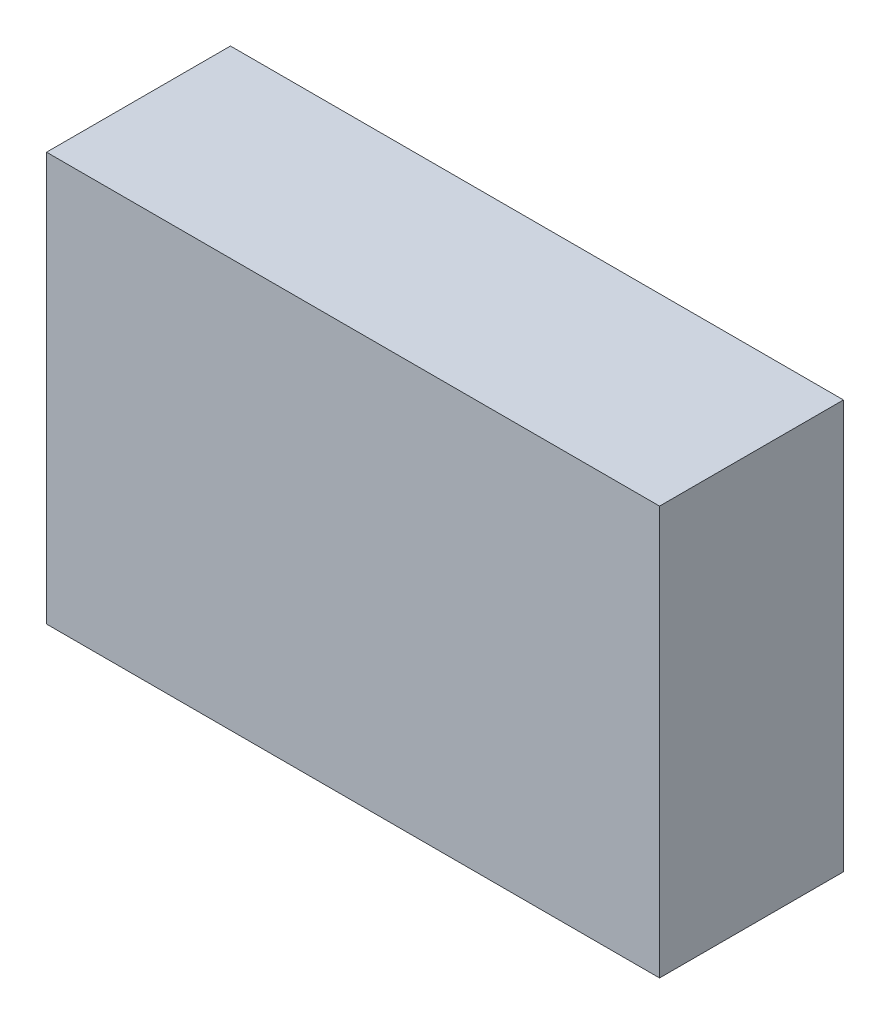
ISO-10303-21;
HEADER;
FILE_DESCRIPTION(('STEP AP214'),'2;1');
FILE_NAME('part.step','',(''),(''),'','','');
FILE_SCHEMA(('AUTOMOTIVE_DESIGN { 1 0 10303 214 1 1 1 1 }'));
ENDSEC;
DATA;
#1=APPLICATION_CONTEXT('core data for automotive mechanical design processes');
#2=APPLICATION_PROTOCOL_DEFINITION('international standard','automotive_design',2000,#1);
#3=PRODUCT_CONTEXT('',#1,'mechanical');
#4=PRODUCT('Part','Part','',(#3));
#5=PRODUCT_RELATED_PRODUCT_CATEGORY('part','',(#4));
#6=PRODUCT_DEFINITION_FORMATION('','',#4);
#7=PRODUCT_DEFINITION_CONTEXT('part definition',#1,'design');
#8=PRODUCT_DEFINITION('design','',#6,#7);
#9=PRODUCT_DEFINITION_SHAPE('','',#8);
#10=(LENGTH_UNIT() NAMED_UNIT(*) SI_UNIT(.MILLI.,.METRE.));
#11=(NAMED_UNIT(*) PLANE_ANGLE_UNIT() SI_UNIT($,.RADIAN.));
#12=(NAMED_UNIT(*) SI_UNIT($,.STERADIAN.) SOLID_ANGLE_UNIT());
#13=UNCERTAINTY_MEASURE_WITH_UNIT(LENGTH_MEASURE(1.E-05),#10,'distance_accuracy_value','');
#14=(GEOMETRIC_REPRESENTATION_CONTEXT(3) GLOBAL_UNCERTAINTY_ASSIGNED_CONTEXT((#13)) GLOBAL_UNIT_ASSIGNED_CONTEXT((#10,
#11,#12)) REPRESENTATION_CONTEXT('',''));
#15=CARTESIAN_POINT('',(0.,0.,0.));
#16=DIRECTION('',(0.,0.,1.));
#17=DIRECTION('',(1.,0.,0.));
#18=AXIS2_PLACEMENT_3D('',#15,#16,#17);
#19=CARTESIAN_POINT('',(0.,100.,0.));
#20=DIRECTION('',(1.,0.,0.));
#21=DIRECTION('',(0.,0.,-1.));
#22=AXIS2_PLACEMENT_3D('',#19,#20,#21);
#23=PLANE('',#22);
#24=DIRECTION('',(0.,0.,1.));
#25=VECTOR('',#24,1.);
#26=CARTESIAN_POINT('',(0.,0.,0.));
#27=LINE('',#26,#25);
#28=CARTESIAN_POINT('',(0.,0.,-45.));
#29=VERTEX_POINT('',#28);
#30=CARTESIAN_POINT('',(0.,0.,0.));
#31=VERTEX_POINT('',#30);
#32=EDGE_CURVE('E107',#29,#31,#27,.T.);
#33=ORIENTED_EDGE('',*,*,#32,.T.);
#34=DIRECTION('',(0.,-1.,0.));
#35=VECTOR('',#34,1.);
#36=CARTESIAN_POINT('',(0.,100.,0.));
#37=LINE('',#36,#35);
#38=CARTESIAN_POINT('',(0.,100.,0.));
#39=VERTEX_POINT('',#38);
#40=EDGE_CURVE('E11',#39,#31,#37,.T.);
#41=ORIENTED_EDGE('',*,*,#40,.F.);
#42=DIRECTION('',(0.,0.,1.));
#43=VECTOR('',#42,1.);
#44=CARTESIAN_POINT('',(0.,100.,0.));
#45=LINE('',#44,#43);
#46=CARTESIAN_POINT('',(0.,100.,-45.));
#47=VERTEX_POINT('',#46);
#48=EDGE_CURVE('E91',#47,#39,#45,.T.);
#49=ORIENTED_EDGE('',*,*,#48,.F.);
#50=DIRECTION('',(0.,-1.,0.));
#51=VECTOR('',#50,1.);
#52=CARTESIAN_POINT('',(0.,100.,-45.));
#53=LINE('',#52,#51);
#54=EDGE_CURVE('E103',#47,#29,#53,.T.);
#55=ORIENTED_EDGE('',*,*,#54,.T.);
#56=EDGE_LOOP('',(#33,#41,#49,#55));
#57=FACE_BOUND('',#56,.T.);
#58=ADVANCED_FACE('F39',(#57),#23,.F.);
#59=CARTESIAN_POINT('',(0.,100.,0.));
#60=DIRECTION('',(0.,0.,-1.));
#61=DIRECTION('',(-1.,0.,0.));
#62=AXIS2_PLACEMENT_3D('',#59,#60,#61);
#63=PLANE('',#62);
#64=DIRECTION('',(1.,0.,0.));
#65=VECTOR('',#64,1.);
#66=CARTESIAN_POINT('',(0.,0.,0.));
#67=LINE('',#66,#65);
#68=CARTESIAN_POINT('',(150.,0.,0.));
#69=VERTEX_POINT('',#68);
#70=EDGE_CURVE('E96',#31,#69,#67,.T.);
#71=ORIENTED_EDGE('',*,*,#70,.T.);
#72=DIRECTION('',(0.,-1.,0.));
#73=VECTOR('',#72,1.);
#74=CARTESIAN_POINT('',(150.,100.,0.));
#75=LINE('',#74,#73);
#76=CARTESIAN_POINT('',(150.,100.,0.));
#77=VERTEX_POINT('',#76);
#78=EDGE_CURVE('E48',#77,#69,#75,.T.);
#79=ORIENTED_EDGE('',*,*,#78,.F.);
#80=DIRECTION('',(1.,0.,0.));
#81=VECTOR('',#80,1.);
#82=CARTESIAN_POINT('',(0.,100.,0.));
#83=LINE('',#82,#81);
#84=EDGE_CURVE('E86',#39,#77,#83,.T.);
#85=ORIENTED_EDGE('',*,*,#84,.F.);
#86=ORIENTED_EDGE('',*,*,#40,.T.);
#87=EDGE_LOOP('',(#71,#79,#85,#86));
#88=FACE_BOUND('',#87,.T.);
#89=ADVANCED_FACE('F95',(#88),#63,.F.);
#90=CARTESIAN_POINT('',(150.,100.,0.));
#91=DIRECTION('',(-1.,0.,0.));
#92=DIRECTION('',(0.,0.,1.));
#93=AXIS2_PLACEMENT_3D('',#90,#91,#92);
#94=PLANE('',#93);
#95=DIRECTION('',(0.,0.,-1.));
#96=VECTOR('',#95,1.);
#97=CARTESIAN_POINT('',(150.,0.,0.));
#98=LINE('',#97,#96);
#99=CARTESIAN_POINT('',(150.,0.,-45.));
#100=VERTEX_POINT('',#99);
#101=EDGE_CURVE('E73',#69,#100,#98,.T.);
#102=ORIENTED_EDGE('',*,*,#101,.T.);
#103=DIRECTION('',(0.,-1.,0.));
#104=VECTOR('',#103,1.);
#105=CARTESIAN_POINT('',(150.,100.,-45.));
#106=LINE('',#105,#104);
#107=CARTESIAN_POINT('',(150.,100.,-45.));
#108=VERTEX_POINT('',#107);
#109=EDGE_CURVE('E98',#108,#100,#106,.T.);
#110=ORIENTED_EDGE('',*,*,#109,.F.);
#111=DIRECTION('',(0.,0.,-1.));
#112=VECTOR('',#111,1.);
#113=CARTESIAN_POINT('',(150.,100.,0.));
#114=LINE('',#113,#112);
#115=EDGE_CURVE('E89',#77,#108,#114,.T.);
#116=ORIENTED_EDGE('',*,*,#115,.F.);
#117=ORIENTED_EDGE('',*,*,#78,.T.);
#118=EDGE_LOOP('',(#102,#110,#116,#117));
#119=FACE_BOUND('',#118,.T.);
#120=ADVANCED_FACE('F99',(#119),#94,.F.);
#121=CARTESIAN_POINT('',(0.,100.,-45.));
#122=DIRECTION('',(0.,0.,1.));
#123=DIRECTION('',(1.,0.,0.));
#124=AXIS2_PLACEMENT_3D('',#121,#122,#123);
#125=PLANE('',#124);
#126=DIRECTION('',(-1.,0.,0.));
#127=VECTOR('',#126,1.);
#128=CARTESIAN_POINT('',(0.,0.,-45.));
#129=LINE('',#128,#127);
#130=EDGE_CURVE('E79',#100,#29,#129,.T.);
#131=ORIENTED_EDGE('',*,*,#130,.T.);
#132=ORIENTED_EDGE('',*,*,#54,.F.);
#133=DIRECTION('',(-1.,0.,0.));
#134=VECTOR('',#133,1.);
#135=CARTESIAN_POINT('',(0.,100.,-45.));
#136=LINE('',#135,#134);
#137=EDGE_CURVE('E56',#108,#47,#136,.T.);
#138=ORIENTED_EDGE('',*,*,#137,.F.);
#139=ORIENTED_EDGE('',*,*,#109,.T.);
#140=EDGE_LOOP('',(#131,#132,#138,#139));
#141=FACE_BOUND('',#140,.T.);
#142=ADVANCED_FACE('F120',(#141),#125,.F.);
#143=CARTESIAN_POINT('',(0.,100.,0.));
#144=DIRECTION('',(0.,-1.,0.));
#145=DIRECTION('',(0.,0.,-1.));
#146=AXIS2_PLACEMENT_3D('',#143,#144,#145);
#147=PLANE('',#146);
#148=ORIENTED_EDGE('',*,*,#48,.T.);
#149=ORIENTED_EDGE('',*,*,#84,.T.);
#150=ORIENTED_EDGE('',*,*,#115,.T.);
#151=ORIENTED_EDGE('',*,*,#137,.T.);
#152=EDGE_LOOP('',(#148,#149,#150,#151));
#153=FACE_BOUND('',#152,.T.);
#154=ADVANCED_FACE('F87',(#153),#147,.F.);
#155=CARTESIAN_POINT('',(0.,0.,0.));
#156=DIRECTION('',(0.,-1.,0.));
#157=DIRECTION('',(0.,0.,-1.));
#158=AXIS2_PLACEMENT_3D('',#155,#156,#157);
#159=PLANE('',#158);
#160=ORIENTED_EDGE('',*,*,#32,.F.);
#161=ORIENTED_EDGE('',*,*,#130,.F.);
#162=ORIENTED_EDGE('',*,*,#101,.F.);
#163=ORIENTED_EDGE('',*,*,#70,.F.);
#164=EDGE_LOOP('',(#160,#161,#162,#163));
#165=FACE_BOUND('',#164,.T.);
#166=ADVANCED_FACE('F123',(#165),#159,.T.);
#167=CLOSED_SHELL('',(#58,#89,#120,#142,#154,#166));
#168=MANIFOLD_SOLID_BREP('B2',#167);
#169=ADVANCED_BREP_SHAPE_REPRESENTATION('',(#18,#168),#14);
#170=SHAPE_DEFINITION_REPRESENTATION(#9,#169);
ENDSEC;
END-ISO-10303-21;
